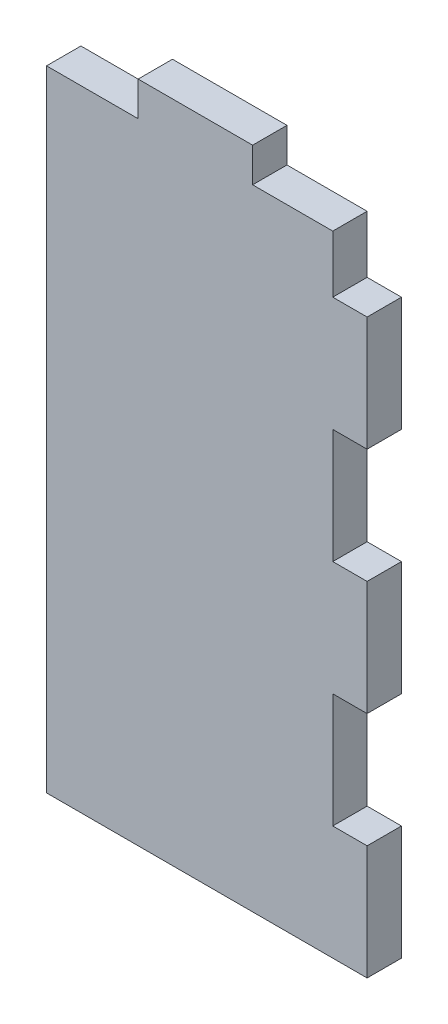
ISO-10303-21;
HEADER;
FILE_DESCRIPTION(('STEP AP214'),'2;1');
FILE_NAME('part.step','',(''),(''),'','','');
FILE_SCHEMA(('AUTOMOTIVE_DESIGN { 1 0 10303 214 1 1 1 1 }'));
ENDSEC;
DATA;
#1=APPLICATION_CONTEXT('core data for automotive mechanical design processes');
#2=APPLICATION_PROTOCOL_DEFINITION('international standard','automotive_design',2000,#1);
#3=PRODUCT_CONTEXT('',#1,'mechanical');
#4=PRODUCT('Part','Part','',(#3));
#5=PRODUCT_RELATED_PRODUCT_CATEGORY('part','',(#4));
#6=PRODUCT_DEFINITION_FORMATION('','',#4);
#7=PRODUCT_DEFINITION_CONTEXT('part definition',#1,'design');
#8=PRODUCT_DEFINITION('design','',#6,#7);
#9=PRODUCT_DEFINITION_SHAPE('','',#8);
#10=(LENGTH_UNIT() NAMED_UNIT(*) SI_UNIT(.MILLI.,.METRE.));
#11=(NAMED_UNIT(*) PLANE_ANGLE_UNIT() SI_UNIT($,.RADIAN.));
#12=(NAMED_UNIT(*) SI_UNIT($,.STERADIAN.) SOLID_ANGLE_UNIT());
#13=UNCERTAINTY_MEASURE_WITH_UNIT(LENGTH_MEASURE(1.E-05),#10,'distance_accuracy_value','');
#14=(GEOMETRIC_REPRESENTATION_CONTEXT(3) GLOBAL_UNCERTAINTY_ASSIGNED_CONTEXT((#13)) GLOBAL_UNIT_ASSIGNED_CONTEXT((#10,
#11,#12)) REPRESENTATION_CONTEXT('',''));
#15=CARTESIAN_POINT('',(0.,0.,0.));
#16=DIRECTION('',(0.,0.,1.));
#17=DIRECTION('',(1.,0.,0.));
#18=AXIS2_PLACEMENT_3D('',#15,#16,#17);
#19=CARTESIAN_POINT('',(28.,0.,3.));
#20=DIRECTION('',(-1.,0.,0.));
#21=DIRECTION('',(0.,-1.,0.));
#22=AXIS2_PLACEMENT_3D('',#19,#20,#21);
#23=PLANE('',#22);
#24=DIRECTION('',(0.,1.,0.));
#25=VECTOR('',#24,1.);
#26=CARTESIAN_POINT('',(28.,0.,0.));
#27=LINE('',#26,#25);
#28=CARTESIAN_POINT('',(28.,-38.,0.));
#29=VERTEX_POINT('',#28);
#30=CARTESIAN_POINT('',(28.,-28.,0.));
#31=VERTEX_POINT('',#30);
#32=EDGE_CURVE('E183',#29,#31,#27,.T.);
#33=ORIENTED_EDGE('',*,*,#32,.T.);
#34=DIRECTION('',(0.,0.,1.));
#35=VECTOR('',#34,1.);
#36=CARTESIAN_POINT('',(28.,-28.,0.));
#37=LINE('',#36,#35);
#38=CARTESIAN_POINT('',(28.,-28.,3.));
#39=VERTEX_POINT('',#38);
#40=EDGE_CURVE('E300',#31,#39,#37,.T.);
#41=ORIENTED_EDGE('',*,*,#40,.T.);
#42=DIRECTION('',(0.,1.,0.));
#43=VECTOR('',#42,1.);
#44=CARTESIAN_POINT('',(28.,0.,3.));
#45=LINE('',#44,#43);
#46=CARTESIAN_POINT('',(28.,-38.,3.));
#47=VERTEX_POINT('',#46);
#48=EDGE_CURVE('E252',#47,#39,#45,.T.);
#49=ORIENTED_EDGE('',*,*,#48,.F.);
#50=DIRECTION('',(0.,0.,1.));
#51=VECTOR('',#50,1.);
#52=CARTESIAN_POINT('',(28.,-38.,0.));
#53=LINE('',#52,#51);
#54=EDGE_CURVE('E270',#29,#47,#53,.T.);
#55=ORIENTED_EDGE('',*,*,#54,.F.);
#56=EDGE_LOOP('',(#33,#41,#49,#55));
#57=FACE_BOUND('',#56,.T.);
#58=ADVANCED_FACE('F35',(#57),#23,.F.);
#59=CARTESIAN_POINT('',(28.,-58.,0.));
#60=VERTEX_POINT('',#59);
#61=CARTESIAN_POINT('',(28.,-48.,0.));
#62=VERTEX_POINT('',#61);
#63=EDGE_CURVE('E186',#60,#62,#27,.T.);
#64=ORIENTED_EDGE('',*,*,#63,.T.);
#65=DIRECTION('',(0.,0.,1.));
#66=VECTOR('',#65,1.);
#67=CARTESIAN_POINT('',(28.,-48.,0.));
#68=LINE('',#67,#66);
#69=CARTESIAN_POINT('',(28.,-48.,3.));
#70=VERTEX_POINT('',#69);
#71=EDGE_CURVE('E272',#62,#70,#68,.T.);
#72=ORIENTED_EDGE('',*,*,#71,.T.);
#73=CARTESIAN_POINT('',(28.,-58.,3.));
#74=VERTEX_POINT('',#73);
#75=EDGE_CURVE('E249',#74,#70,#45,.T.);
#76=ORIENTED_EDGE('',*,*,#75,.F.);
#77=DIRECTION('',(0.,0.,-1.));
#78=VECTOR('',#77,1.);
#79=CARTESIAN_POINT('',(28.,-58.,3.));
#80=LINE('',#79,#78);
#81=EDGE_CURVE('E206',#74,#60,#80,.T.);
#82=ORIENTED_EDGE('',*,*,#81,.T.);
#83=EDGE_LOOP('',(#64,#72,#76,#82));
#84=FACE_BOUND('',#83,.T.);
#85=ADVANCED_FACE('F353',(#84),#23,.F.);
#86=CARTESIAN_POINT('',(0.,0.,3.));
#87=DIRECTION('',(1.,0.,0.));
#88=DIRECTION('',(0.,1.,0.));
#89=AXIS2_PLACEMENT_3D('',#86,#87,#88);
#90=PLANE('',#89);
#91=DIRECTION('',(0.,-1.,0.));
#92=VECTOR('',#91,1.);
#93=CARTESIAN_POINT('',(0.,0.,3.));
#94=LINE('',#93,#92);
#95=CARTESIAN_POINT('',(0.,-3.,3.));
#96=VERTEX_POINT('',#95);
#97=CARTESIAN_POINT('',(0.,-58.,3.));
#98=VERTEX_POINT('',#97);
#99=EDGE_CURVE('E198',#96,#98,#94,.T.);
#100=ORIENTED_EDGE('',*,*,#99,.F.);
#101=DIRECTION('',(0.,0.,-1.));
#102=VECTOR('',#101,1.);
#103=CARTESIAN_POINT('',(0.,-3.,3.));
#104=LINE('',#103,#102);
#105=CARTESIAN_POINT('',(0.,-3.,0.));
#106=VERTEX_POINT('',#105);
#107=EDGE_CURVE('E220',#96,#106,#104,.T.);
#108=ORIENTED_EDGE('',*,*,#107,.T.);
#109=DIRECTION('',(0.,-1.,0.));
#110=VECTOR('',#109,1.);
#111=CARTESIAN_POINT('',(0.,0.,0.));
#112=LINE('',#111,#110);
#113=CARTESIAN_POINT('',(0.,-58.,0.));
#114=VERTEX_POINT('',#113);
#115=EDGE_CURVE('E188',#106,#114,#112,.T.);
#116=ORIENTED_EDGE('',*,*,#115,.T.);
#117=DIRECTION('',(0.,0.,-1.));
#118=VECTOR('',#117,1.);
#119=CARTESIAN_POINT('',(0.,-58.,3.));
#120=LINE('',#119,#118);
#121=EDGE_CURVE('E208',#98,#114,#120,.T.);
#122=ORIENTED_EDGE('',*,*,#121,.F.);
#123=EDGE_LOOP('',(#100,#108,#116,#122));
#124=FACE_BOUND('',#123,.T.);
#125=ADVANCED_FACE('F37',(#124),#90,.F.);
#126=CARTESIAN_POINT('',(0.,-58.,3.));
#127=DIRECTION('',(0.,1.,0.));
#128=DIRECTION('',(0.,0.,1.));
#129=AXIS2_PLACEMENT_3D('',#126,#127,#128);
#130=PLANE('',#129);
#131=DIRECTION('',(1.,0.,0.));
#132=VECTOR('',#131,1.);
#133=CARTESIAN_POINT('',(0.,-58.,0.));
#134=LINE('',#133,#132);
#135=EDGE_CURVE('E184',#114,#60,#134,.T.);
#136=ORIENTED_EDGE('',*,*,#135,.T.);
#137=ORIENTED_EDGE('',*,*,#81,.F.);
#138=DIRECTION('',(1.,0.,0.));
#139=VECTOR('',#138,1.);
#140=CARTESIAN_POINT('',(0.,-58.,3.));
#141=LINE('',#140,#139);
#142=EDGE_CURVE('E203',#98,#74,#141,.T.);
#143=ORIENTED_EDGE('',*,*,#142,.F.);
#144=ORIENTED_EDGE('',*,*,#121,.T.);
#145=EDGE_LOOP('',(#136,#137,#143,#144));
#146=FACE_BOUND('',#145,.T.);
#147=ADVANCED_FACE('F360',(#146),#130,.F.);
#148=CARTESIAN_POINT('',(28.,-18.,3.));
#149=VERTEX_POINT('',#148);
#150=CARTESIAN_POINT('',(28.,-8.,3.));
#151=VERTEX_POINT('',#150);
#152=EDGE_CURVE('E176',#149,#151,#45,.T.);
#153=ORIENTED_EDGE('',*,*,#152,.F.);
#154=DIRECTION('',(0.,0.,1.));
#155=VECTOR('',#154,1.);
#156=CARTESIAN_POINT('',(28.,-18.,0.));
#157=LINE('',#156,#155);
#158=CARTESIAN_POINT('',(28.,-18.,0.));
#159=VERTEX_POINT('',#158);
#160=EDGE_CURVE('E162',#159,#149,#157,.T.);
#161=ORIENTED_EDGE('',*,*,#160,.F.);
#162=CARTESIAN_POINT('',(28.,-8.,0.));
#163=VERTEX_POINT('',#162);
#164=EDGE_CURVE('E174',#159,#163,#27,.T.);
#165=ORIENTED_EDGE('',*,*,#164,.T.);
#166=DIRECTION('',(0.,0.,1.));
#167=VECTOR('',#166,1.);
#168=CARTESIAN_POINT('',(28.,-8.,0.));
#169=LINE('',#168,#167);
#170=EDGE_CURVE('E310',#163,#151,#169,.T.);
#171=ORIENTED_EDGE('',*,*,#170,.T.);
#172=EDGE_LOOP('',(#153,#161,#165,#171));
#173=FACE_BOUND('',#172,.T.);
#174=ADVANCED_FACE('F172',(#173),#23,.F.);
#175=CARTESIAN_POINT('',(0.,0.,3.));
#176=DIRECTION('',(0.,-1.,0.));
#177=DIRECTION('',(0.,0.,-1.));
#178=AXIS2_PLACEMENT_3D('',#175,#176,#177);
#179=PLANE('',#178);
#180=DIRECTION('',(-1.,0.,0.));
#181=VECTOR('',#180,1.);
#182=CARTESIAN_POINT('',(0.,0.,0.));
#183=LINE('',#182,#181);
#184=CARTESIAN_POINT('',(18.,0.,0.));
#185=VERTEX_POINT('',#184);
#186=CARTESIAN_POINT('',(8.00000000000001,0.,0.));
#187=VERTEX_POINT('',#186);
#188=EDGE_CURVE('E192',#185,#187,#183,.T.);
#189=ORIENTED_EDGE('',*,*,#188,.T.);
#190=DIRECTION('',(0.,0.,1.));
#191=VECTOR('',#190,1.);
#192=CARTESIAN_POINT('',(8.00000000000001,0.,0.));
#193=LINE('',#192,#191);
#194=CARTESIAN_POINT('',(8.00000000000001,0.,3.));
#195=VERTEX_POINT('',#194);
#196=EDGE_CURVE('E232',#187,#195,#193,.T.);
#197=ORIENTED_EDGE('',*,*,#196,.T.);
#198=DIRECTION('',(-1.,0.,0.));
#199=VECTOR('',#198,1.);
#200=CARTESIAN_POINT('',(0.,0.,3.));
#201=LINE('',#200,#199);
#202=CARTESIAN_POINT('',(18.,0.,3.));
#203=VERTEX_POINT('',#202);
#204=EDGE_CURVE('E209',#203,#195,#201,.T.);
#205=ORIENTED_EDGE('',*,*,#204,.F.);
#206=DIRECTION('',(0.,0.,1.));
#207=VECTOR('',#206,1.);
#208=CARTESIAN_POINT('',(18.,0.,0.));
#209=LINE('',#208,#207);
#210=EDGE_CURVE('E241',#185,#203,#209,.T.);
#211=ORIENTED_EDGE('',*,*,#210,.F.);
#212=EDGE_LOOP('',(#189,#197,#205,#211));
#213=FACE_BOUND('',#212,.T.);
#214=ADVANCED_FACE('F263',(#213),#179,.F.);
#215=CARTESIAN_POINT('',(0.,0.,3.));
#216=DIRECTION('',(0.,0.,1.));
#217=DIRECTION('',(1.,0.,0.));
#218=AXIS2_PLACEMENT_3D('',#215,#216,#217);
#219=PLANE('',#218);
#220=DIRECTION('',(1.,0.,0.));
#221=VECTOR('',#220,1.);
#222=CARTESIAN_POINT('',(28.,-28.,3.));
#223=LINE('',#222,#221);
#224=CARTESIAN_POINT('',(25.,-28.,3.));
#225=VERTEX_POINT('',#224);
#226=EDGE_CURVE('E167',#225,#39,#223,.T.);
#227=ORIENTED_EDGE('',*,*,#226,.F.);
#228=DIRECTION('',(0.,-1.,0.));
#229=VECTOR('',#228,1.);
#230=CARTESIAN_POINT('',(25.,-18.,3.));
#231=LINE('',#230,#229);
#232=CARTESIAN_POINT('',(25.,-18.,3.));
#233=VERTEX_POINT('',#232);
#234=EDGE_CURVE('E325',#233,#225,#231,.T.);
#235=ORIENTED_EDGE('',*,*,#234,.F.);
#236=DIRECTION('',(-1.,0.,0.));
#237=VECTOR('',#236,1.);
#238=CARTESIAN_POINT('',(28.,-18.,3.));
#239=LINE('',#238,#237);
#240=EDGE_CURVE('E312',#149,#233,#239,.T.);
#241=ORIENTED_EDGE('',*,*,#240,.F.);
#242=ORIENTED_EDGE('',*,*,#152,.T.);
#243=DIRECTION('',(1.,0.,0.));
#244=VECTOR('',#243,1.);
#245=CARTESIAN_POINT('',(28.,-8.,3.));
#246=LINE('',#245,#244);
#247=CARTESIAN_POINT('',(25.,-8.,3.));
#248=VERTEX_POINT('',#247);
#249=EDGE_CURVE('E313',#248,#151,#246,.T.);
#250=ORIENTED_EDGE('',*,*,#249,.F.);
#251=DIRECTION('',(0.,-1.,0.));
#252=VECTOR('',#251,1.);
#253=CARTESIAN_POINT('',(25.,2.,3.));
#254=LINE('',#253,#252);
#255=CARTESIAN_POINT('',(25.,-3.,3.));
#256=VERTEX_POINT('',#255);
#257=EDGE_CURVE('E315',#256,#248,#254,.T.);
#258=ORIENTED_EDGE('',*,*,#257,.F.);
#259=DIRECTION('',(1.,0.,0.));
#260=VECTOR('',#259,1.);
#261=CARTESIAN_POINT('',(28.,-3.,3.));
#262=LINE('',#261,#260);
#263=CARTESIAN_POINT('',(18.,-3.,3.));
#264=VERTEX_POINT('',#263);
#265=EDGE_CURVE('E230',#264,#256,#262,.T.);
#266=ORIENTED_EDGE('',*,*,#265,.F.);
#267=DIRECTION('',(0.,-1.,0.));
#268=VECTOR('',#267,1.);
#269=CARTESIAN_POINT('',(18.,0.,3.));
#270=LINE('',#269,#268);
#271=EDGE_CURVE('E227',#203,#264,#270,.T.);
#272=ORIENTED_EDGE('',*,*,#271,.F.);
#273=ORIENTED_EDGE('',*,*,#204,.T.);
#274=DIRECTION('',(0.,1.,0.));
#275=VECTOR('',#274,1.);
#276=CARTESIAN_POINT('',(8.00000000000001,0.,3.));
#277=LINE('',#276,#275);
#278=CARTESIAN_POINT('',(8.00000000000001,-3.,3.));
#279=VERTEX_POINT('',#278);
#280=EDGE_CURVE('E261',#279,#195,#277,.T.);
#281=ORIENTED_EDGE('',*,*,#280,.F.);
#282=DIRECTION('',(1.,0.,0.));
#283=VECTOR('',#282,1.);
#284=CARTESIAN_POINT('',(8.00000000000001,-3.,3.));
#285=LINE('',#284,#283);
#286=EDGE_CURVE('E265',#96,#279,#285,.T.);
#287=ORIENTED_EDGE('',*,*,#286,.F.);
#288=ORIENTED_EDGE('',*,*,#99,.T.);
#289=ORIENTED_EDGE('',*,*,#142,.T.);
#290=ORIENTED_EDGE('',*,*,#75,.T.);
#291=DIRECTION('',(1.,0.,0.));
#292=VECTOR('',#291,1.);
#293=CARTESIAN_POINT('',(28.,-48.,3.));
#294=LINE('',#293,#292);
#295=CARTESIAN_POINT('',(25.,-48.,3.));
#296=VERTEX_POINT('',#295);
#297=EDGE_CURVE('E279',#296,#70,#294,.T.);
#298=ORIENTED_EDGE('',*,*,#297,.F.);
#299=DIRECTION('',(0.,-1.,0.));
#300=VECTOR('',#299,1.);
#301=CARTESIAN_POINT('',(25.,-38.,3.));
#302=LINE('',#301,#300);
#303=CARTESIAN_POINT('',(25.,-38.,3.));
#304=VERTEX_POINT('',#303);
#305=EDGE_CURVE('E299',#304,#296,#302,.T.);
#306=ORIENTED_EDGE('',*,*,#305,.F.);
#307=DIRECTION('',(-1.,0.,0.));
#308=VECTOR('',#307,1.);
#309=CARTESIAN_POINT('',(28.,-38.,3.));
#310=LINE('',#309,#308);
#311=EDGE_CURVE('E298',#47,#304,#310,.T.);
#312=ORIENTED_EDGE('',*,*,#311,.F.);
#313=ORIENTED_EDGE('',*,*,#48,.T.);
#314=EDGE_LOOP('',(#227,#235,#241,#242,#250,#258,#266,#272,#273,#281,#287,#288,#289,#290,#298,
#306,#312,#313));
#315=FACE_BOUND('',#314,.T.);
#316=ADVANCED_FACE('F260',(#315),#219,.T.);
#317=CARTESIAN_POINT('',(0.,0.,0.));
#318=DIRECTION('',(0.,0.,1.));
#319=DIRECTION('',(1.,0.,0.));
#320=AXIS2_PLACEMENT_3D('',#317,#318,#319);
#321=PLANE('',#320);
#322=DIRECTION('',(0.,-1.,0.));
#323=VECTOR('',#322,1.);
#324=CARTESIAN_POINT('',(25.,-18.,0.));
#325=LINE('',#324,#323);
#326=CARTESIAN_POINT('',(25.,-18.,0.));
#327=VERTEX_POINT('',#326);
#328=CARTESIAN_POINT('',(25.,-28.,0.));
#329=VERTEX_POINT('',#328);
#330=EDGE_CURVE('E50',#327,#329,#325,.T.);
#331=ORIENTED_EDGE('',*,*,#330,.T.);
#332=DIRECTION('',(1.,0.,0.));
#333=VECTOR('',#332,1.);
#334=CARTESIAN_POINT('',(28.,-28.,0.));
#335=LINE('',#334,#333);
#336=EDGE_CURVE('E177',#329,#31,#335,.T.);
#337=ORIENTED_EDGE('',*,*,#336,.T.);
#338=ORIENTED_EDGE('',*,*,#32,.F.);
#339=DIRECTION('',(-1.,0.,0.));
#340=VECTOR('',#339,1.);
#341=CARTESIAN_POINT('',(28.,-38.,0.));
#342=LINE('',#341,#340);
#343=CARTESIAN_POINT('',(25.,-38.,0.));
#344=VERTEX_POINT('',#343);
#345=EDGE_CURVE('E294',#29,#344,#342,.T.);
#346=ORIENTED_EDGE('',*,*,#345,.T.);
#347=DIRECTION('',(0.,-1.,0.));
#348=VECTOR('',#347,1.);
#349=CARTESIAN_POINT('',(25.,-38.,0.));
#350=LINE('',#349,#348);
#351=CARTESIAN_POINT('',(25.,-48.,0.));
#352=VERTEX_POINT('',#351);
#353=EDGE_CURVE('E290',#344,#352,#350,.T.);
#354=ORIENTED_EDGE('',*,*,#353,.T.);
#355=DIRECTION('',(1.,0.,0.));
#356=VECTOR('',#355,1.);
#357=CARTESIAN_POINT('',(28.,-48.,0.));
#358=LINE('',#357,#356);
#359=EDGE_CURVE('E285',#352,#62,#358,.T.);
#360=ORIENTED_EDGE('',*,*,#359,.T.);
#361=ORIENTED_EDGE('',*,*,#63,.F.);
#362=ORIENTED_EDGE('',*,*,#135,.F.);
#363=ORIENTED_EDGE('',*,*,#115,.F.);
#364=DIRECTION('',(1.,0.,0.));
#365=VECTOR('',#364,1.);
#366=CARTESIAN_POINT('',(0.,-3.,0.));
#367=LINE('',#366,#365);
#368=CARTESIAN_POINT('',(8.00000000000001,-3.,0.));
#369=VERTEX_POINT('',#368);
#370=EDGE_CURVE('E43',#106,#369,#367,.T.);
#371=ORIENTED_EDGE('',*,*,#370,.T.);
#372=DIRECTION('',(0.,1.,0.));
#373=VECTOR('',#372,1.);
#374=CARTESIAN_POINT('',(8.00000000000001,0.,0.));
#375=LINE('',#374,#373);
#376=EDGE_CURVE('E214',#369,#187,#375,.T.);
#377=ORIENTED_EDGE('',*,*,#376,.T.);
#378=ORIENTED_EDGE('',*,*,#188,.F.);
#379=DIRECTION('',(0.,-1.,0.));
#380=VECTOR('',#379,1.);
#381=CARTESIAN_POINT('',(18.,0.,0.));
#382=LINE('',#381,#380);
#383=CARTESIAN_POINT('',(18.,-3.,0.));
#384=VERTEX_POINT('',#383);
#385=EDGE_CURVE('E236',#185,#384,#382,.T.);
#386=ORIENTED_EDGE('',*,*,#385,.T.);
#387=DIRECTION('',(1.,0.,0.));
#388=VECTOR('',#387,1.);
#389=CARTESIAN_POINT('',(28.,-3.,0.));
#390=LINE('',#389,#388);
#391=CARTESIAN_POINT('',(25.,-3.,0.));
#392=VERTEX_POINT('',#391);
#393=EDGE_CURVE('E239',#384,#392,#390,.T.);
#394=ORIENTED_EDGE('',*,*,#393,.T.);
#395=DIRECTION('',(0.,-1.,0.));
#396=VECTOR('',#395,1.);
#397=CARTESIAN_POINT('',(25.,2.,0.));
#398=LINE('',#397,#396);
#399=CARTESIAN_POINT('',(25.,-8.,0.));
#400=VERTEX_POINT('',#399);
#401=EDGE_CURVE('E58',#392,#400,#398,.T.);
#402=ORIENTED_EDGE('',*,*,#401,.T.);
#403=DIRECTION('',(1.,0.,0.));
#404=VECTOR('',#403,1.);
#405=CARTESIAN_POINT('',(28.,-8.,0.));
#406=LINE('',#405,#404);
#407=EDGE_CURVE('E182',#400,#163,#406,.T.);
#408=ORIENTED_EDGE('',*,*,#407,.T.);
#409=ORIENTED_EDGE('',*,*,#164,.F.);
#410=DIRECTION('',(-1.,0.,0.));
#411=VECTOR('',#410,1.);
#412=CARTESIAN_POINT('',(28.,-18.,0.));
#413=LINE('',#412,#411);
#414=EDGE_CURVE('E158',#159,#327,#413,.T.);
#415=ORIENTED_EDGE('',*,*,#414,.T.);
#416=EDGE_LOOP('',(#331,#337,#338,#346,#354,#360,#361,#362,#363,#371,#377,#378,#386,#394,#402,
#408,#409,#415));
#417=FACE_BOUND('',#416,.T.);
#418=ADVANCED_FACE('F180',(#417),#321,.F.);
#419=CARTESIAN_POINT('',(28.,-3.,0.));
#420=DIRECTION('',(0.,-1.,0.));
#421=DIRECTION('',(1.,0.,0.));
#422=AXIS2_PLACEMENT_3D('',#419,#420,#421);
#423=PLANE('',#422);
#424=ORIENTED_EDGE('',*,*,#265,.T.);
#425=DIRECTION('',(0.,0.,-1.));
#426=VECTOR('',#425,1.);
#427=CARTESIAN_POINT('',(25.,-3.,0.));
#428=LINE('',#427,#426);
#429=EDGE_CURVE('E11',#256,#392,#428,.T.);
#430=ORIENTED_EDGE('',*,*,#429,.T.);
#431=ORIENTED_EDGE('',*,*,#393,.F.);
#432=DIRECTION('',(0.,0.,1.));
#433=VECTOR('',#432,1.);
#434=CARTESIAN_POINT('',(18.,-3.,0.));
#435=LINE('',#434,#433);
#436=EDGE_CURVE('E245',#384,#264,#435,.T.);
#437=ORIENTED_EDGE('',*,*,#436,.T.);
#438=EDGE_LOOP('',(#424,#430,#431,#437));
#439=FACE_BOUND('',#438,.T.);
#440=ADVANCED_FACE('F385',(#439),#423,.F.);
#441=CARTESIAN_POINT('',(18.,0.,0.));
#442=DIRECTION('',(-1.,0.,0.));
#443=DIRECTION('',(0.,-1.,0.));
#444=AXIS2_PLACEMENT_3D('',#441,#442,#443);
#445=PLANE('',#444);
#446=ORIENTED_EDGE('',*,*,#271,.T.);
#447=ORIENTED_EDGE('',*,*,#436,.F.);
#448=ORIENTED_EDGE('',*,*,#385,.F.);
#449=ORIENTED_EDGE('',*,*,#210,.T.);
#450=EDGE_LOOP('',(#446,#447,#448,#449));
#451=FACE_BOUND('',#450,.T.);
#452=ADVANCED_FACE('F381',(#451),#445,.F.);
#453=CARTESIAN_POINT('',(8.00000000000001,-3.,0.));
#454=DIRECTION('',(0.,-1.,0.));
#455=DIRECTION('',(1.,0.,0.));
#456=AXIS2_PLACEMENT_3D('',#453,#454,#455);
#457=PLANE('',#456);
#458=ORIENTED_EDGE('',*,*,#286,.T.);
#459=DIRECTION('',(0.,0.,1.));
#460=VECTOR('',#459,1.);
#461=CARTESIAN_POINT('',(8.00000000000001,-3.,0.));
#462=LINE('',#461,#460);
#463=EDGE_CURVE('E223',#369,#279,#462,.T.);
#464=ORIENTED_EDGE('',*,*,#463,.F.);
#465=ORIENTED_EDGE('',*,*,#370,.F.);
#466=ORIENTED_EDGE('',*,*,#107,.F.);
#467=EDGE_LOOP('',(#458,#464,#465,#466));
#468=FACE_BOUND('',#467,.T.);
#469=ADVANCED_FACE('F219',(#468),#457,.F.);
#470=CARTESIAN_POINT('',(8.00000000000001,0.,0.));
#471=DIRECTION('',(1.,0.,0.));
#472=DIRECTION('',(0.,1.,0.));
#473=AXIS2_PLACEMENT_3D('',#470,#471,#472);
#474=PLANE('',#473);
#475=ORIENTED_EDGE('',*,*,#280,.T.);
#476=ORIENTED_EDGE('',*,*,#196,.F.);
#477=ORIENTED_EDGE('',*,*,#376,.F.);
#478=ORIENTED_EDGE('',*,*,#463,.T.);
#479=EDGE_LOOP('',(#475,#476,#477,#478));
#480=FACE_BOUND('',#479,.T.);
#481=ADVANCED_FACE('F371',(#480),#474,.F.);
#482=CARTESIAN_POINT('',(28.,-48.,0.));
#483=DIRECTION('',(0.,-1.,0.));
#484=DIRECTION('',(0.,0.,-1.));
#485=AXIS2_PLACEMENT_3D('',#482,#483,#484);
#486=PLANE('',#485);
#487=ORIENTED_EDGE('',*,*,#297,.T.);
#488=ORIENTED_EDGE('',*,*,#71,.F.);
#489=ORIENTED_EDGE('',*,*,#359,.F.);
#490=DIRECTION('',(0.,0.,1.));
#491=VECTOR('',#490,1.);
#492=CARTESIAN_POINT('',(25.,-48.,0.));
#493=LINE('',#492,#491);
#494=EDGE_CURVE('E273',#352,#296,#493,.T.);
#495=ORIENTED_EDGE('',*,*,#494,.T.);
#496=EDGE_LOOP('',(#487,#488,#489,#495));
#497=FACE_BOUND('',#496,.T.);
#498=ADVANCED_FACE('F373',(#497),#486,.F.);
#499=CARTESIAN_POINT('',(25.,-38.,0.));
#500=DIRECTION('',(-1.,0.,0.));
#501=DIRECTION('',(0.,-1.,0.));
#502=AXIS2_PLACEMENT_3D('',#499,#500,#501);
#503=PLANE('',#502);
#504=ORIENTED_EDGE('',*,*,#305,.T.);
#505=ORIENTED_EDGE('',*,*,#494,.F.);
#506=ORIENTED_EDGE('',*,*,#353,.F.);
#507=DIRECTION('',(0.,0.,1.));
#508=VECTOR('',#507,1.);
#509=CARTESIAN_POINT('',(25.,-38.,0.));
#510=LINE('',#509,#508);
#511=EDGE_CURVE('E276',#344,#304,#510,.T.);
#512=ORIENTED_EDGE('',*,*,#511,.T.);
#513=EDGE_LOOP('',(#504,#505,#506,#512));
#514=FACE_BOUND('',#513,.T.);
#515=ADVANCED_FACE('F379',(#514),#503,.F.);
#516=CARTESIAN_POINT('',(28.,-38.,0.));
#517=DIRECTION('',(0.,1.,0.));
#518=DIRECTION('',(-1.,0.,0.));
#519=AXIS2_PLACEMENT_3D('',#516,#517,#518);
#520=PLANE('',#519);
#521=ORIENTED_EDGE('',*,*,#311,.T.);
#522=ORIENTED_EDGE('',*,*,#511,.F.);
#523=ORIENTED_EDGE('',*,*,#345,.F.);
#524=ORIENTED_EDGE('',*,*,#54,.T.);
#525=EDGE_LOOP('',(#521,#522,#523,#524));
#526=FACE_BOUND('',#525,.T.);
#527=ADVANCED_FACE('F441',(#526),#520,.F.);
#528=CARTESIAN_POINT('',(25.,2.,0.));
#529=DIRECTION('',(-1.,0.,0.));
#530=DIRECTION('',(0.,-1.,0.));
#531=AXIS2_PLACEMENT_3D('',#528,#529,#530);
#532=PLANE('',#531);
#533=ORIENTED_EDGE('',*,*,#257,.T.);
#534=DIRECTION('',(0.,0.,1.));
#535=VECTOR('',#534,1.);
#536=CARTESIAN_POINT('',(25.,-8.,0.));
#537=LINE('',#536,#535);
#538=EDGE_CURVE('E307',#400,#248,#537,.T.);
#539=ORIENTED_EDGE('',*,*,#538,.F.);
#540=ORIENTED_EDGE('',*,*,#401,.F.);
#541=ORIENTED_EDGE('',*,*,#429,.F.);
#542=EDGE_LOOP('',(#533,#539,#540,#541));
#543=FACE_BOUND('',#542,.T.);
#544=ADVANCED_FACE('F349',(#543),#532,.F.);
#545=CARTESIAN_POINT('',(28.,-8.,0.));
#546=DIRECTION('',(0.,-1.,0.));
#547=DIRECTION('',(0.,0.,-1.));
#548=AXIS2_PLACEMENT_3D('',#545,#546,#547);
#549=PLANE('',#548);
#550=ORIENTED_EDGE('',*,*,#249,.T.);
#551=ORIENTED_EDGE('',*,*,#170,.F.);
#552=ORIENTED_EDGE('',*,*,#407,.F.);
#553=ORIENTED_EDGE('',*,*,#538,.T.);
#554=EDGE_LOOP('',(#550,#551,#552,#553));
#555=FACE_BOUND('',#554,.T.);
#556=ADVANCED_FACE('F342',(#555),#549,.F.);
#557=CARTESIAN_POINT('',(28.,-28.,0.));
#558=DIRECTION('',(0.,-1.,0.));
#559=DIRECTION('',(0.,0.,-1.));
#560=AXIS2_PLACEMENT_3D('',#557,#558,#559);
#561=PLANE('',#560);
#562=ORIENTED_EDGE('',*,*,#226,.T.);
#563=ORIENTED_EDGE('',*,*,#40,.F.);
#564=ORIENTED_EDGE('',*,*,#336,.F.);
#565=DIRECTION('',(0.,0.,1.));
#566=VECTOR('',#565,1.);
#567=CARTESIAN_POINT('',(25.,-28.,0.));
#568=LINE('',#567,#566);
#569=EDGE_CURVE('E320',#329,#225,#568,.T.);
#570=ORIENTED_EDGE('',*,*,#569,.T.);
#571=EDGE_LOOP('',(#562,#563,#564,#570));
#572=FACE_BOUND('',#571,.T.);
#573=ADVANCED_FACE('F340',(#572),#561,.F.);
#574=CARTESIAN_POINT('',(25.,-18.,0.));
#575=DIRECTION('',(-1.,0.,0.));
#576=DIRECTION('',(0.,-1.,0.));
#577=AXIS2_PLACEMENT_3D('',#574,#575,#576);
#578=PLANE('',#577);
#579=ORIENTED_EDGE('',*,*,#234,.T.);
#580=ORIENTED_EDGE('',*,*,#569,.F.);
#581=ORIENTED_EDGE('',*,*,#330,.F.);
#582=DIRECTION('',(0.,0.,1.));
#583=VECTOR('',#582,1.);
#584=CARTESIAN_POINT('',(25.,-18.,0.));
#585=LINE('',#584,#583);
#586=EDGE_CURVE('E164',#327,#233,#585,.T.);
#587=ORIENTED_EDGE('',*,*,#586,.T.);
#588=EDGE_LOOP('',(#579,#580,#581,#587));
#589=FACE_BOUND('',#588,.T.);
#590=ADVANCED_FACE('F339',(#589),#578,.F.);
#591=CARTESIAN_POINT('',(28.,-18.,0.));
#592=DIRECTION('',(0.,1.,0.));
#593=DIRECTION('',(-1.,0.,0.));
#594=AXIS2_PLACEMENT_3D('',#591,#592,#593);
#595=PLANE('',#594);
#596=ORIENTED_EDGE('',*,*,#240,.T.);
#597=ORIENTED_EDGE('',*,*,#586,.F.);
#598=ORIENTED_EDGE('',*,*,#414,.F.);
#599=ORIENTED_EDGE('',*,*,#160,.T.);
#600=EDGE_LOOP('',(#596,#597,#598,#599));
#601=FACE_BOUND('',#600,.T.);
#602=ADVANCED_FACE('F161',(#601),#595,.F.);
#603=CLOSED_SHELL('',(#58,#85,#125,#147,#174,#214,#316,#418,#440,#452,#469,#481,#498,#515,#527,
#544,#556,#573,#590,#602));
#604=MANIFOLD_SOLID_BREP('B2',#603);
#605=ADVANCED_BREP_SHAPE_REPRESENTATION('',(#18,#604),#14);
#606=SHAPE_DEFINITION_REPRESENTATION(#9,#605);
ENDSEC;
END-ISO-10303-21;
